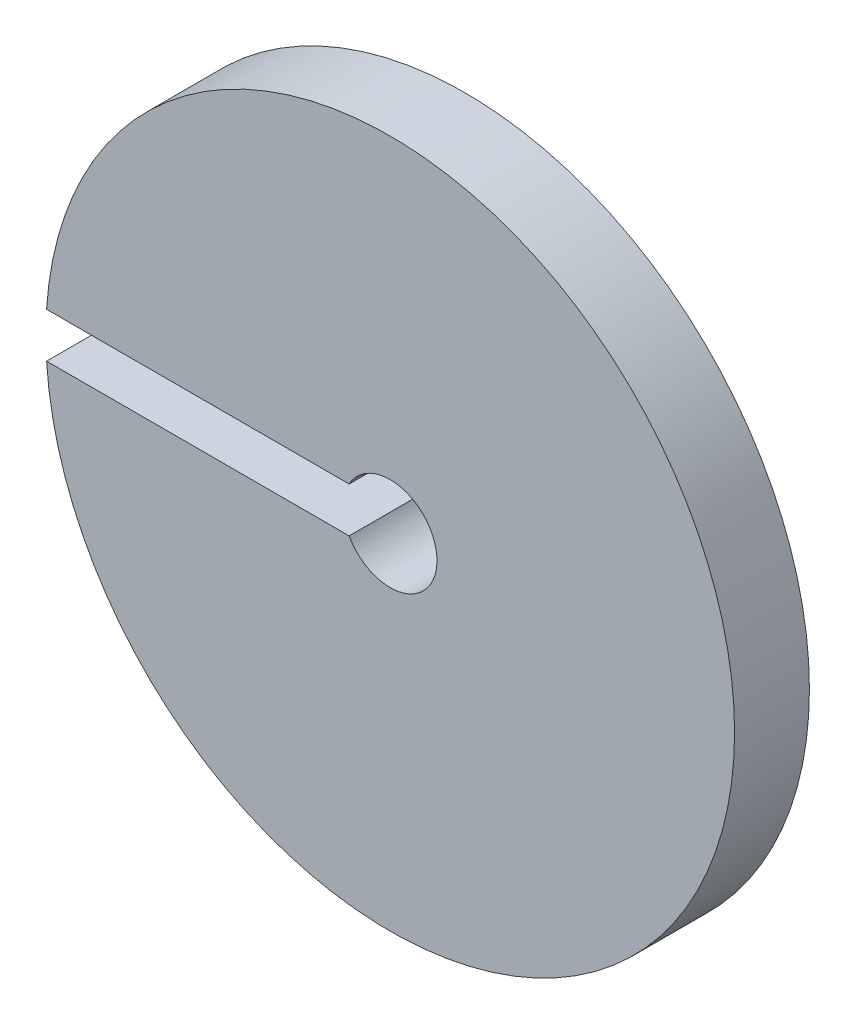
ISO-10303-21;
HEADER;
FILE_DESCRIPTION(('STEP AP214'),'2;1');
FILE_NAME('part.step','',(''),(''),'','','');
FILE_SCHEMA(('AUTOMOTIVE_DESIGN { 1 0 10303 214 1 1 1 1 }'));
ENDSEC;
DATA;
#1=APPLICATION_CONTEXT('core data for automotive mechanical design processes');
#2=APPLICATION_PROTOCOL_DEFINITION('international standard','automotive_design',2000,#1);
#3=PRODUCT_CONTEXT('',#1,'mechanical');
#4=PRODUCT('Part','Part','',(#3));
#5=PRODUCT_RELATED_PRODUCT_CATEGORY('part','',(#4));
#6=PRODUCT_DEFINITION_FORMATION('','',#4);
#7=PRODUCT_DEFINITION_CONTEXT('part definition',#1,'design');
#8=PRODUCT_DEFINITION('design','',#6,#7);
#9=PRODUCT_DEFINITION_SHAPE('','',#8);
#10=(LENGTH_UNIT() NAMED_UNIT(*) SI_UNIT(.MILLI.,.METRE.));
#11=(NAMED_UNIT(*) PLANE_ANGLE_UNIT() SI_UNIT($,.RADIAN.));
#12=(NAMED_UNIT(*) SI_UNIT($,.STERADIAN.) SOLID_ANGLE_UNIT());
#13=UNCERTAINTY_MEASURE_WITH_UNIT(LENGTH_MEASURE(1.E-05),#10,'distance_accuracy_value','');
#14=(GEOMETRIC_REPRESENTATION_CONTEXT(3) GLOBAL_UNCERTAINTY_ASSIGNED_CONTEXT((#13)) GLOBAL_UNIT_ASSIGNED_CONTEXT((#10,
#11,#12)) REPRESENTATION_CONTEXT('',''));
#15=CARTESIAN_POINT('',(0.,0.,0.));
#16=DIRECTION('',(0.,0.,1.));
#17=DIRECTION('',(1.,0.,0.));
#18=AXIS2_PLACEMENT_3D('',#15,#16,#17);
#19=CARTESIAN_POINT('',(0.,0.,5.));
#20=DIRECTION('',(0.,0.,-1.));
#21=DIRECTION('',(-1.,0.,0.));
#22=AXIS2_PLACEMENT_3D('',#19,#20,#21);
#23=CYLINDRICAL_SURFACE('',#22,23.);
#24=CARTESIAN_POINT('',(0.,0.,0.));
#25=DIRECTION('',(0.,0.,1.));
#26=DIRECTION('',(1.,0.,0.));
#27=AXIS2_PLACEMENT_3D('',#24,#25,#26);
#28=CIRCLE('',#27,23.);
#29=CARTESIAN_POINT('',(-22.951034835057,-1.5,0.));
#30=VERTEX_POINT('',#29);
#31=CARTESIAN_POINT('',(-22.951034835057,1.5,0.));
#32=VERTEX_POINT('',#31);
#33=EDGE_CURVE('E33',#30,#32,#28,.T.);
#34=ORIENTED_EDGE('',*,*,#33,.T.);
#35=DIRECTION('',(0.,0.,-1.));
#36=VECTOR('',#35,1.);
#37=CARTESIAN_POINT('',(-22.951034835057,1.5,5.));
#38=LINE('',#37,#36);
#39=CARTESIAN_POINT('',(-22.951034835057,1.5,5.));
#40=VERTEX_POINT('',#39);
#41=EDGE_CURVE('E89',#32,#40,#38,.F.);
#42=ORIENTED_EDGE('',*,*,#41,.T.);
#43=CARTESIAN_POINT('',(0.,0.,5.));
#44=DIRECTION('',(0.,0.,1.));
#45=DIRECTION('',(1.,0.,0.));
#46=AXIS2_PLACEMENT_3D('',#43,#44,#45);
#47=CIRCLE('',#46,23.);
#48=CARTESIAN_POINT('',(-22.951034835057,-1.5,5.));
#49=VERTEX_POINT('',#48);
#50=EDGE_CURVE('E11',#49,#40,#47,.T.);
#51=ORIENTED_EDGE('',*,*,#50,.F.);
#52=DIRECTION('',(0.,0.,-1.));
#53=VECTOR('',#52,1.);
#54=CARTESIAN_POINT('',(-22.951034835057,-1.5,5.));
#55=LINE('',#54,#53);
#56=EDGE_CURVE('E76',#49,#30,#55,.T.);
#57=ORIENTED_EDGE('',*,*,#56,.T.);
#58=EDGE_LOOP('',(#34,#42,#51,#57));
#59=FACE_BOUND('',#58,.T.);
#60=ADVANCED_FACE('F30',(#59),#23,.T.);
#61=CARTESIAN_POINT('',(0.,0.,5.));
#62=DIRECTION('',(0.,0.,1.));
#63=DIRECTION('',(1.,0.,0.));
#64=AXIS2_PLACEMENT_3D('',#61,#62,#63);
#65=PLANE('',#64);
#66=DIRECTION('',(1.,0.,0.));
#67=VECTOR('',#66,1.);
#68=CARTESIAN_POINT('',(-2.74146402493266,1.5,5.));
#69=LINE('',#68,#67);
#70=CARTESIAN_POINT('',(-2.74146402493266,1.5,5.));
#71=VERTEX_POINT('',#70);
#72=EDGE_CURVE('E70',#40,#71,#69,.T.);
#73=ORIENTED_EDGE('',*,*,#72,.T.);
#74=CARTESIAN_POINT('',(0.,0.,5.));
#75=DIRECTION('',(0.,0.,-1.));
#76=DIRECTION('',(-1.,0.,0.));
#77=AXIS2_PLACEMENT_3D('',#74,#75,#76);
#78=CIRCLE('',#77,3.125);
#79=CARTESIAN_POINT('',(-2.74146402493266,-1.5,5.));
#80=VERTEX_POINT('',#79);
#81=EDGE_CURVE('E82',#71,#80,#78,.T.);
#82=ORIENTED_EDGE('',*,*,#81,.T.);
#83=DIRECTION('',(-1.,0.,0.));
#84=VECTOR('',#83,1.);
#85=CARTESIAN_POINT('',(-2.74146402493266,-1.5,5.));
#86=LINE('',#85,#84);
#87=EDGE_CURVE('E52',#80,#49,#86,.T.);
#88=ORIENTED_EDGE('',*,*,#87,.T.);
#89=ORIENTED_EDGE('',*,*,#50,.T.);
#90=EDGE_LOOP('',(#73,#82,#88,#89));
#91=FACE_BOUND('',#90,.T.);
#92=ADVANCED_FACE('F81',(#91),#65,.T.);
#93=CARTESIAN_POINT('',(0.,0.,0.));
#94=DIRECTION('',(0.,0.,1.));
#95=DIRECTION('',(1.,0.,0.));
#96=AXIS2_PLACEMENT_3D('',#93,#94,#95);
#97=PLANE('',#96);
#98=CARTESIAN_POINT('',(0.,0.,0.));
#99=DIRECTION('',(0.,0.,-1.));
#100=DIRECTION('',(-1.,0.,0.));
#101=AXIS2_PLACEMENT_3D('',#98,#99,#100);
#102=CIRCLE('',#101,3.125);
#103=CARTESIAN_POINT('',(-2.74146402493266,1.5,0.));
#104=VERTEX_POINT('',#103);
#105=CARTESIAN_POINT('',(-2.74146402493266,-1.5,0.));
#106=VERTEX_POINT('',#105);
#107=EDGE_CURVE('E86',#104,#106,#102,.T.);
#108=ORIENTED_EDGE('',*,*,#107,.F.);
#109=DIRECTION('',(1.,0.,0.));
#110=VECTOR('',#109,1.);
#111=CARTESIAN_POINT('',(-2.74146402493266,1.5,0.));
#112=LINE('',#111,#110);
#113=EDGE_CURVE('E44',#32,#104,#112,.T.);
#114=ORIENTED_EDGE('',*,*,#113,.F.);
#115=ORIENTED_EDGE('',*,*,#33,.F.);
#116=DIRECTION('',(-1.,0.,0.));
#117=VECTOR('',#116,1.);
#118=CARTESIAN_POINT('',(-2.74146402493266,-1.5,0.));
#119=LINE('',#118,#117);
#120=EDGE_CURVE('E97',#106,#30,#119,.T.);
#121=ORIENTED_EDGE('',*,*,#120,.F.);
#122=EDGE_LOOP('',(#108,#114,#115,#121));
#123=FACE_BOUND('',#122,.T.);
#124=ADVANCED_FACE('F102',(#123),#97,.F.);
#125=CARTESIAN_POINT('',(0.,0.,5.));
#126=DIRECTION('',(0.,0.,-1.));
#127=DIRECTION('',(-1.,0.,0.));
#128=AXIS2_PLACEMENT_3D('',#125,#126,#127);
#129=CYLINDRICAL_SURFACE('',#128,3.125);
#130=ORIENTED_EDGE('',*,*,#81,.F.);
#131=DIRECTION('',(0.,0.,-1.));
#132=VECTOR('',#131,1.);
#133=CARTESIAN_POINT('',(-2.74146402493266,1.5,5.));
#134=LINE('',#133,#132);
#135=EDGE_CURVE('E67',#71,#104,#134,.T.);
#136=ORIENTED_EDGE('',*,*,#135,.T.);
#137=ORIENTED_EDGE('',*,*,#107,.T.);
#138=DIRECTION('',(0.,0.,-1.));
#139=VECTOR('',#138,1.);
#140=CARTESIAN_POINT('',(-2.74146402493266,-1.5,5.));
#141=LINE('',#140,#139);
#142=EDGE_CURVE('E77',#80,#106,#141,.T.);
#143=ORIENTED_EDGE('',*,*,#142,.F.);
#144=EDGE_LOOP('',(#130,#136,#137,#143));
#145=FACE_BOUND('',#144,.T.);
#146=ADVANCED_FACE('F85',(#145),#129,.F.);
#147=CARTESIAN_POINT('',(-2.74146402493266,-1.5,5.));
#148=DIRECTION('',(0.,-1.,0.));
#149=DIRECTION('',(0.,0.,-1.));
#150=AXIS2_PLACEMENT_3D('',#147,#148,#149);
#151=PLANE('',#150);
#152=ORIENTED_EDGE('',*,*,#87,.F.);
#153=ORIENTED_EDGE('',*,*,#142,.T.);
#154=ORIENTED_EDGE('',*,*,#120,.T.);
#155=ORIENTED_EDGE('',*,*,#56,.F.);
#156=EDGE_LOOP('',(#152,#153,#154,#155));
#157=FACE_BOUND('',#156,.T.);
#158=ADVANCED_FACE('F104',(#157),#151,.F.);
#159=CARTESIAN_POINT('',(-2.74146402493266,1.5,5.));
#160=DIRECTION('',(0.,1.,0.));
#161=DIRECTION('',(0.,0.,1.));
#162=AXIS2_PLACEMENT_3D('',#159,#160,#161);
#163=PLANE('',#162);
#164=ORIENTED_EDGE('',*,*,#113,.T.);
#165=ORIENTED_EDGE('',*,*,#135,.F.);
#166=ORIENTED_EDGE('',*,*,#72,.F.);
#167=ORIENTED_EDGE('',*,*,#41,.F.);
#168=EDGE_LOOP('',(#164,#165,#166,#167));
#169=FACE_BOUND('',#168,.T.);
#170=ADVANCED_FACE('F69',(#169),#163,.F.);
#171=CLOSED_SHELL('',(#60,#92,#124,#146,#158,#170));
#172=MANIFOLD_SOLID_BREP('B2',#171);
#173=ADVANCED_BREP_SHAPE_REPRESENTATION('',(#18,#172),#14);
#174=SHAPE_DEFINITION_REPRESENTATION(#9,#173);
ENDSEC;
END-ISO-10303-21;
